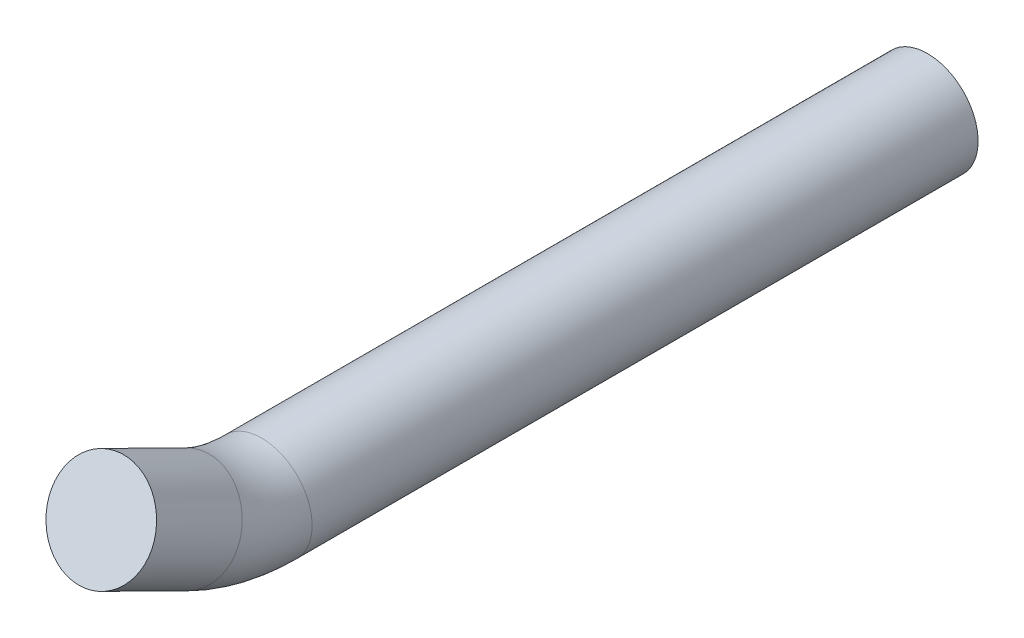
ISO-10303-21;
HEADER;
FILE_DESCRIPTION(('STEP AP214'),'2;1');
FILE_NAME('part.step','',(''),(''),'','','');
FILE_SCHEMA(('AUTOMOTIVE_DESIGN { 1 0 10303 214 1 1 1 1 }'));
ENDSEC;
DATA;
#1=APPLICATION_CONTEXT('core data for automotive mechanical design processes');
#2=APPLICATION_PROTOCOL_DEFINITION('international standard','automotive_design',2000,#1);
#3=PRODUCT_CONTEXT('',#1,'mechanical');
#4=PRODUCT('Part','Part','',(#3));
#5=PRODUCT_RELATED_PRODUCT_CATEGORY('part','',(#4));
#6=PRODUCT_DEFINITION_FORMATION('','',#4);
#7=PRODUCT_DEFINITION_CONTEXT('part definition',#1,'design');
#8=PRODUCT_DEFINITION('design','',#6,#7);
#9=PRODUCT_DEFINITION_SHAPE('','',#8);
#10=(LENGTH_UNIT() NAMED_UNIT(*) SI_UNIT(.MILLI.,.METRE.));
#11=(NAMED_UNIT(*) PLANE_ANGLE_UNIT() SI_UNIT($,.RADIAN.));
#12=(NAMED_UNIT(*) SI_UNIT($,.STERADIAN.) SOLID_ANGLE_UNIT());
#13=UNCERTAINTY_MEASURE_WITH_UNIT(LENGTH_MEASURE(1.E-05),#10,'distance_accuracy_value','');
#14=(GEOMETRIC_REPRESENTATION_CONTEXT(3) GLOBAL_UNCERTAINTY_ASSIGNED_CONTEXT((#13)) GLOBAL_UNIT_ASSIGNED_CONTEXT((#10,
#11,#12)) REPRESENTATION_CONTEXT('',''));
#15=CARTESIAN_POINT('',(0.,0.,0.));
#16=DIRECTION('',(0.,0.,1.));
#17=DIRECTION('',(1.,0.,0.));
#18=AXIS2_PLACEMENT_3D('',#15,#16,#17);
#19=CARTESIAN_POINT('',(0.,0.,170.));
#20=DIRECTION('',(0.,0.,-1.));
#21=DIRECTION('',(-1.,0.,0.));
#22=AXIS2_PLACEMENT_3D('',#19,#20,#21);
#23=CYLINDRICAL_SURFACE('',#22,15.);
#24=CARTESIAN_POINT('',(0.,0.,177.488017399542));
#25=DIRECTION('',(0.,0.,1.));
#26=DIRECTION('',(1.,0.,0.));
#27=AXIS2_PLACEMENT_3D('',#24,#25,#26);
#28=CIRCLE('',#27,15.);
#29=CARTESIAN_POINT('',(0.,-15.,177.488017399542));
#30=VERTEX_POINT('',#29);
#31=EDGE_CURVE('E53',#30,#30,#28,.T.);
#32=ORIENTED_EDGE('',*,*,#31,.F.);
#33=EDGE_LOOP('',(#32));
#34=FACE_BOUND('',#33,.T.);
#35=CARTESIAN_POINT('',(0.,0.,-20.));
#36=DIRECTION('',(0.,0.,-1.));
#37=DIRECTION('',(-1.,0.,0.));
#38=AXIS2_PLACEMENT_3D('',#35,#36,#37);
#39=CIRCLE('',#38,15.);
#40=CARTESIAN_POINT('',(-15.,0.,-20.));
#41=VERTEX_POINT('',#40);
#42=EDGE_CURVE('E55',#41,#41,#39,.T.);
#43=ORIENTED_EDGE('',*,*,#42,.F.);
#44=EDGE_LOOP('',(#43));
#45=FACE_BOUND('',#44,.T.);
#46=ADVANCED_FACE('F33',(#34,#45),#23,.T.);
#47=CARTESIAN_POINT('',(0.,17.7190482862128,225.027928795247));
#48=DIRECTION('',(0.,0.44297620715532,0.896533367975943));
#49=DIRECTION('',(1.,0.,0.));
#50=AXIS2_PLACEMENT_3D('',#47,#48,#49);
#51=PLANE('',#50);
#52=CARTESIAN_POINT('',(0.,17.7190482862128,225.027928795247));
#53=DIRECTION('',(0.,0.44297620715532,0.896533367975943));
#54=DIRECTION('',(1.,0.,0.));
#55=AXIS2_PLACEMENT_3D('',#52,#53,#54);
#56=CIRCLE('',#55,15.);
#57=CARTESIAN_POINT('',(15.,17.7190482862128,225.027928795247));
#58=VERTEX_POINT('',#57);
#59=EDGE_CURVE('E11',#58,#58,#56,.T.);
#60=ORIENTED_EDGE('',*,*,#59,.T.);
#61=EDGE_LOOP('',(#60));
#62=FACE_BOUND('',#61,.T.);
#63=ADVANCED_FACE('F42',(#62),#51,.T.);
#64=CARTESIAN_POINT('',(0.,50.,177.488017399542));
#65=DIRECTION('',(-1.,0.,0.));
#66=DIRECTION('',(0.,0.,1.));
#67=AXIS2_PLACEMENT_3D('',#64,#65,#66);
#68=TOROIDAL_SURFACE('',#67,50.,15.);
#69=CARTESIAN_POINT('',(0.,5.17333160120285,199.636827757307));
#70=DIRECTION('',(0.,0.442976207155319,0.896533367975943));
#71=DIRECTION('',(1.,0.,0.));
#72=AXIS2_PLACEMENT_3D('',#69,#70,#71);
#73=CIRCLE('',#72,15.);
#74=CARTESIAN_POINT('',(0.,-8.27466891843629,206.281470864637));
#75=VERTEX_POINT('',#74);
#76=EDGE_CURVE('E39',#75,#75,#73,.T.);
#77=CARTESIAN_POINT('',(0.,50.,177.488017399542));
#78=DIRECTION('',(-1.,0.,0.));
#79=DIRECTION('',(0.,0.,1.));
#80=AXIS2_PLACEMENT_3D('',#77,#78,#79);
#81=CIRCLE('',#80,65.);
#82=EDGE_CURVE('',#30,#75,#81,.T.);
#83=ORIENTED_EDGE('',*,*,#31,.T.);
#84=ORIENTED_EDGE('',*,*,#76,.F.);
#85=ORIENTED_EDGE('',*,*,#82,.T.);
#86=ORIENTED_EDGE('',*,*,#82,.F.);
#87=EDGE_LOOP('',(#83,#85,#84,#86));
#88=FACE_BOUND('',#87,.T.);
#89=ADVANCED_FACE('F48',(#88),#68,.T.);
#90=CARTESIAN_POINT('',(0.,5.17333160120285,199.636827757307));
#91=DIRECTION('',(0.,0.44297620715532,0.896533367975943));
#92=DIRECTION('',(0.,-0.896533367975943,0.44297620715532));
#93=AXIS2_PLACEMENT_3D('',#90,#91,#92);
#94=CYLINDRICAL_SURFACE('',#93,15.);
#95=ORIENTED_EDGE('',*,*,#59,.F.);
#96=EDGE_LOOP('',(#95));
#97=FACE_BOUND('',#96,.T.);
#98=ORIENTED_EDGE('',*,*,#76,.T.);
#99=EDGE_LOOP('',(#98));
#100=FACE_BOUND('',#99,.T.);
#101=ADVANCED_FACE('F44',(#97,#100),#94,.T.);
#102=CARTESIAN_POINT('',(0.,0.,-20.));
#103=DIRECTION('',(0.,0.,-1.));
#104=DIRECTION('',(-1.,0.,0.));
#105=AXIS2_PLACEMENT_3D('',#102,#103,#104);
#106=PLANE('',#105);
#107=ORIENTED_EDGE('',*,*,#42,.T.);
#108=EDGE_LOOP('',(#107));
#109=FACE_BOUND('',#108,.T.);
#110=ADVANCED_FACE('F47',(#109),#106,.T.);
#111=CLOSED_SHELL('',(#46,#63,#89,#101,#110));
#112=MANIFOLD_SOLID_BREP('B2',#111);
#113=ADVANCED_BREP_SHAPE_REPRESENTATION('',(#18,#112),#14);
#114=SHAPE_DEFINITION_REPRESENTATION(#9,#113);
ENDSEC;
END-ISO-10303-21;
